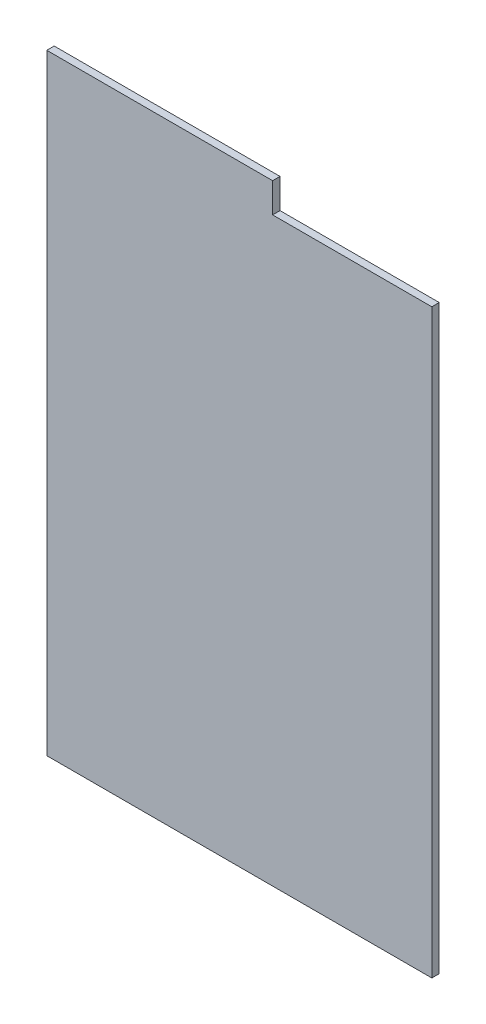
ISO-10303-21;
HEADER;
FILE_DESCRIPTION(('STEP AP214'),'2;1');
FILE_NAME('part.step','',(''),(''),'','','');
FILE_SCHEMA(('AUTOMOTIVE_DESIGN { 1 0 10303 214 1 1 1 1 }'));
ENDSEC;
DATA;
#1=APPLICATION_CONTEXT('core data for automotive mechanical design processes');
#2=APPLICATION_PROTOCOL_DEFINITION('international standard','automotive_design',2000,#1);
#3=PRODUCT_CONTEXT('',#1,'mechanical');
#4=PRODUCT('Part','Part','',(#3));
#5=PRODUCT_RELATED_PRODUCT_CATEGORY('part','',(#4));
#6=PRODUCT_DEFINITION_FORMATION('','',#4);
#7=PRODUCT_DEFINITION_CONTEXT('part definition',#1,'design');
#8=PRODUCT_DEFINITION('design','',#6,#7);
#9=PRODUCT_DEFINITION_SHAPE('','',#8);
#10=(LENGTH_UNIT() NAMED_UNIT(*) SI_UNIT(.MILLI.,.METRE.));
#11=(NAMED_UNIT(*) PLANE_ANGLE_UNIT() SI_UNIT($,.RADIAN.));
#12=(NAMED_UNIT(*) SI_UNIT($,.STERADIAN.) SOLID_ANGLE_UNIT());
#13=UNCERTAINTY_MEASURE_WITH_UNIT(LENGTH_MEASURE(1.E-05),#10,'distance_accuracy_value','');
#14=(GEOMETRIC_REPRESENTATION_CONTEXT(3) GLOBAL_UNCERTAINTY_ASSIGNED_CONTEXT((#13)) GLOBAL_UNIT_ASSIGNED_CONTEXT((#10,
#11,#12)) REPRESENTATION_CONTEXT('',''));
#15=CARTESIAN_POINT('',(0.,0.,0.));
#16=DIRECTION('',(0.,0.,1.));
#17=DIRECTION('',(1.,0.,0.));
#18=AXIS2_PLACEMENT_3D('',#15,#16,#17);
#19=CARTESIAN_POINT('',(2.22044604925032E-13,660.4,88.9));
#20=DIRECTION('',(0.,0.,1.));
#21=DIRECTION('',(1.,0.,0.));
#22=AXIS2_PLACEMENT_3D('',#19,#20,#21);
#23=PLANE('',#22);
#24=DIRECTION('',(0.,1.,0.));
#25=VECTOR('',#24,1.);
#26=CARTESIAN_POINT('',(-660.4,660.4,88.9));
#27=LINE('',#26,#25);
#28=CARTESIAN_POINT('',(-660.4,323.85,88.9));
#29=VERTEX_POINT('',#28);
#30=CARTESIAN_POINT('',(-660.4,1371.6,88.9));
#31=VERTEX_POINT('',#30);
#32=EDGE_CURVE('E11',#29,#31,#27,.T.);
#33=ORIENTED_EDGE('',*,*,#32,.F.);
#34=DIRECTION('',(1.,0.,0.));
#35=VECTOR('',#34,1.);
#36=CARTESIAN_POINT('',(-660.4,323.85,88.9));
#37=LINE('',#36,#35);
#38=CARTESIAN_POINT('',(4.44089209850063E-13,323.85,88.9));
#39=VERTEX_POINT('',#38);
#40=EDGE_CURVE('E106',#29,#39,#37,.T.);
#41=ORIENTED_EDGE('',*,*,#40,.T.);
#42=DIRECTION('',(0.,-1.,0.));
#43=VECTOR('',#42,1.);
#44=CARTESIAN_POINT('',(2.22044604925032E-13,822.325,88.9));
#45=LINE('',#44,#43);
#46=CARTESIAN_POINT('',(0.,1320.8,88.9));
#47=VERTEX_POINT('',#46);
#48=EDGE_CURVE('E116',#47,#39,#45,.T.);
#49=ORIENTED_EDGE('',*,*,#48,.F.);
#50=DIRECTION('',(-1.,0.,0.));
#51=VECTOR('',#50,1.);
#52=CARTESIAN_POINT('',(-136.525,1320.8,88.9));
#53=LINE('',#52,#51);
#54=CARTESIAN_POINT('',(-273.05,1320.8,88.9));
#55=VERTEX_POINT('',#54);
#56=EDGE_CURVE('E101',#47,#55,#53,.T.);
#57=ORIENTED_EDGE('',*,*,#56,.T.);
#58=DIRECTION('',(0.,1.,0.));
#59=VECTOR('',#58,1.);
#60=CARTESIAN_POINT('',(-273.05,1346.2,88.9));
#61=LINE('',#60,#59);
#62=CARTESIAN_POINT('',(-273.05,1371.6,88.9));
#63=VERTEX_POINT('',#62);
#64=EDGE_CURVE('E87',#55,#63,#61,.T.);
#65=ORIENTED_EDGE('',*,*,#64,.T.);
#66=DIRECTION('',(-1.,0.,0.));
#67=VECTOR('',#66,1.);
#68=CARTESIAN_POINT('',(-796.925,1371.6,88.9));
#69=LINE('',#68,#67);
#70=EDGE_CURVE('E99',#63,#31,#69,.T.);
#71=ORIENTED_EDGE('',*,*,#70,.T.);
#72=EDGE_LOOP('',(#33,#41,#49,#57,#65,#71));
#73=FACE_BOUND('',#72,.T.);
#74=ADVANCED_FACE('F16',(#73),#23,.T.);
#75=CARTESIAN_POINT('',(-273.05,1346.2,88.902));
#76=DIRECTION('',(-1.,0.,0.));
#77=DIRECTION('',(0.,0.,1.));
#78=AXIS2_PLACEMENT_3D('',#75,#76,#77);
#79=PLANE('',#78);
#80=ORIENTED_EDGE('',*,*,#64,.F.);
#81=DIRECTION('',(0.,0.,-1.));
#82=VECTOR('',#81,1.);
#83=CARTESIAN_POINT('',(-273.05,1320.8,88.902));
#84=LINE('',#83,#82);
#85=CARTESIAN_POINT('',(-273.05,1320.8,76.2));
#86=VERTEX_POINT('',#85);
#87=EDGE_CURVE('E95',#55,#86,#84,.T.);
#88=ORIENTED_EDGE('',*,*,#87,.T.);
#89=DIRECTION('',(0.,1.,0.));
#90=VECTOR('',#89,1.);
#91=CARTESIAN_POINT('',(-273.05,1346.2,76.2));
#92=LINE('',#91,#90);
#93=CARTESIAN_POINT('',(-273.05,1371.6,76.2));
#94=VERTEX_POINT('',#93);
#95=EDGE_CURVE('E89',#86,#94,#92,.T.);
#96=ORIENTED_EDGE('',*,*,#95,.T.);
#97=DIRECTION('',(0.,0.,-1.));
#98=VECTOR('',#97,1.);
#99=CARTESIAN_POINT('',(-273.05,1371.6,88.902));
#100=LINE('',#99,#98);
#101=EDGE_CURVE('E84',#63,#94,#100,.T.);
#102=ORIENTED_EDGE('',*,*,#101,.F.);
#103=EDGE_LOOP('',(#80,#88,#96,#102));
#104=FACE_BOUND('',#103,.T.);
#105=ADVANCED_FACE('F86',(#104),#79,.F.);
#106=CARTESIAN_POINT('',(-796.925,1371.6,88.902));
#107=DIRECTION('',(0.,-1.,0.));
#108=DIRECTION('',(0.,0.,-1.));
#109=AXIS2_PLACEMENT_3D('',#106,#107,#108);
#110=PLANE('',#109);
#111=DIRECTION('',(-1.,0.,0.));
#112=VECTOR('',#111,1.);
#113=CARTESIAN_POINT('',(-796.925,1371.6,76.2));
#114=LINE('',#113,#112);
#115=CARTESIAN_POINT('',(-660.4,1371.6,76.2));
#116=VERTEX_POINT('',#115);
#117=EDGE_CURVE('E139',#94,#116,#114,.T.);
#118=ORIENTED_EDGE('',*,*,#117,.T.);
#119=DIRECTION('',(0.,0.,1.));
#120=VECTOR('',#119,1.);
#121=CARTESIAN_POINT('',(-660.4,1371.6,88.902));
#122=LINE('',#121,#120);
#123=EDGE_CURVE('E26',#116,#31,#122,.T.);
#124=ORIENTED_EDGE('',*,*,#123,.T.);
#125=ORIENTED_EDGE('',*,*,#70,.F.);
#126=ORIENTED_EDGE('',*,*,#101,.T.);
#127=EDGE_LOOP('',(#118,#124,#125,#126));
#128=FACE_BOUND('',#127,.T.);
#129=ADVANCED_FACE('F104',(#128),#110,.F.);
#130=CARTESIAN_POINT('',(-660.4,847.725,76.2));
#131=DIRECTION('',(0.,0.,1.));
#132=DIRECTION('',(1.,0.,0.));
#133=AXIS2_PLACEMENT_3D('',#130,#131,#132);
#134=PLANE('',#133);
#135=DIRECTION('',(1.,0.,0.));
#136=VECTOR('',#135,1.);
#137=CARTESIAN_POINT('',(-660.4,323.85,76.2));
#138=LINE('',#137,#136);
#139=CARTESIAN_POINT('',(-660.4,323.85,76.2));
#140=VERTEX_POINT('',#139);
#141=CARTESIAN_POINT('',(4.44089209850063E-13,323.85,76.2));
#142=VERTEX_POINT('',#141);
#143=EDGE_CURVE('E130',#140,#142,#138,.T.);
#144=ORIENTED_EDGE('',*,*,#143,.F.);
#145=DIRECTION('',(0.,1.,0.));
#146=VECTOR('',#145,1.);
#147=CARTESIAN_POINT('',(-660.4,847.725,76.2));
#148=LINE('',#147,#146);
#149=EDGE_CURVE('E209',#140,#116,#148,.T.);
#150=ORIENTED_EDGE('',*,*,#149,.T.);
#151=ORIENTED_EDGE('',*,*,#117,.F.);
#152=ORIENTED_EDGE('',*,*,#95,.F.);
#153=DIRECTION('',(-1.,0.,0.));
#154=VECTOR('',#153,1.);
#155=CARTESIAN_POINT('',(-136.525,1320.8,76.2));
#156=LINE('',#155,#154);
#157=CARTESIAN_POINT('',(0.,1320.8,76.2));
#158=VERTEX_POINT('',#157);
#159=EDGE_CURVE('E146',#158,#86,#156,.T.);
#160=ORIENTED_EDGE('',*,*,#159,.F.);
#161=DIRECTION('',(0.,-1.,0.));
#162=VECTOR('',#161,1.);
#163=CARTESIAN_POINT('',(2.22044604925032E-13,822.325,76.2));
#164=LINE('',#163,#162);
#165=EDGE_CURVE('E122',#158,#142,#164,.T.);
#166=ORIENTED_EDGE('',*,*,#165,.T.);
#167=EDGE_LOOP('',(#144,#150,#151,#152,#160,#166));
#168=FACE_BOUND('',#167,.T.);
#169=ADVANCED_FACE('F236',(#168),#134,.F.);
#170=CARTESIAN_POINT('',(-660.4,323.85,88.902));
#171=DIRECTION('',(0.,1.,0.));
#172=DIRECTION('',(0.,0.,1.));
#173=AXIS2_PLACEMENT_3D('',#170,#171,#172);
#174=PLANE('',#173);
#175=ORIENTED_EDGE('',*,*,#40,.F.);
#176=DIRECTION('',(0.,0.,-1.));
#177=VECTOR('',#176,1.);
#178=CARTESIAN_POINT('',(-660.4,323.85,88.902));
#179=LINE('',#178,#177);
#180=EDGE_CURVE('E20',#29,#140,#179,.T.);
#181=ORIENTED_EDGE('',*,*,#180,.T.);
#182=ORIENTED_EDGE('',*,*,#143,.T.);
#183=DIRECTION('',(0.,0.,-1.));
#184=VECTOR('',#183,1.);
#185=CARTESIAN_POINT('',(4.44089209850063E-13,323.85,88.902));
#186=LINE('',#185,#184);
#187=EDGE_CURVE('E94',#39,#142,#186,.T.);
#188=ORIENTED_EDGE('',*,*,#187,.F.);
#189=EDGE_LOOP('',(#175,#181,#182,#188));
#190=FACE_BOUND('',#189,.T.);
#191=ADVANCED_FACE('F172',(#190),#174,.F.);
#192=CARTESIAN_POINT('',(-136.525,1320.8,88.902));
#193=DIRECTION('',(0.,-1.,0.));
#194=DIRECTION('',(0.,0.,-1.));
#195=AXIS2_PLACEMENT_3D('',#192,#193,#194);
#196=PLANE('',#195);
#197=ORIENTED_EDGE('',*,*,#56,.F.);
#198=DIRECTION('',(0.,0.,-1.));
#199=VECTOR('',#198,1.);
#200=CARTESIAN_POINT('',(0.,1320.8,88.902));
#201=LINE('',#200,#199);
#202=EDGE_CURVE('E120',#47,#158,#201,.T.);
#203=ORIENTED_EDGE('',*,*,#202,.T.);
#204=ORIENTED_EDGE('',*,*,#159,.T.);
#205=ORIENTED_EDGE('',*,*,#87,.F.);
#206=EDGE_LOOP('',(#197,#203,#204,#205));
#207=FACE_BOUND('',#206,.T.);
#208=ADVANCED_FACE('F167',(#207),#196,.F.);
#209=CARTESIAN_POINT('',(2.22044604925032E-13,822.325,88.902));
#210=DIRECTION('',(1.,0.,0.));
#211=DIRECTION('',(0.,1.,0.));
#212=AXIS2_PLACEMENT_3D('',#209,#210,#211);
#213=PLANE('',#212);
#214=ORIENTED_EDGE('',*,*,#202,.F.);
#215=ORIENTED_EDGE('',*,*,#48,.T.);
#216=ORIENTED_EDGE('',*,*,#187,.T.);
#217=ORIENTED_EDGE('',*,*,#165,.F.);
#218=EDGE_LOOP('',(#214,#215,#216,#217));
#219=FACE_BOUND('',#218,.T.);
#220=ADVANCED_FACE('F18',(#219),#213,.T.);
#221=CARTESIAN_POINT('',(-660.4,835.025,82.55));
#222=DIRECTION('',(1.,0.,0.));
#223=DIRECTION('',(0.,1.,0.));
#224=AXIS2_PLACEMENT_3D('',#221,#222,#223);
#225=PLANE('',#224);
#226=ORIENTED_EDGE('',*,*,#32,.T.);
#227=ORIENTED_EDGE('',*,*,#123,.F.);
#228=ORIENTED_EDGE('',*,*,#149,.F.);
#229=ORIENTED_EDGE('',*,*,#180,.F.);
#230=EDGE_LOOP('',(#226,#227,#228,#229));
#231=FACE_BOUND('',#230,.T.);
#232=ADVANCED_FACE('F193',(#231),#225,.F.);
#233=CLOSED_SHELL('',(#74,#105,#129,#169,#191,#208,#220,#232));
#234=MANIFOLD_SOLID_BREP('B1',#233);
#235=ADVANCED_BREP_SHAPE_REPRESENTATION('',(#18,#234),#14);
#236=SHAPE_DEFINITION_REPRESENTATION(#9,#235);
ENDSEC;
END-ISO-10303-21;
